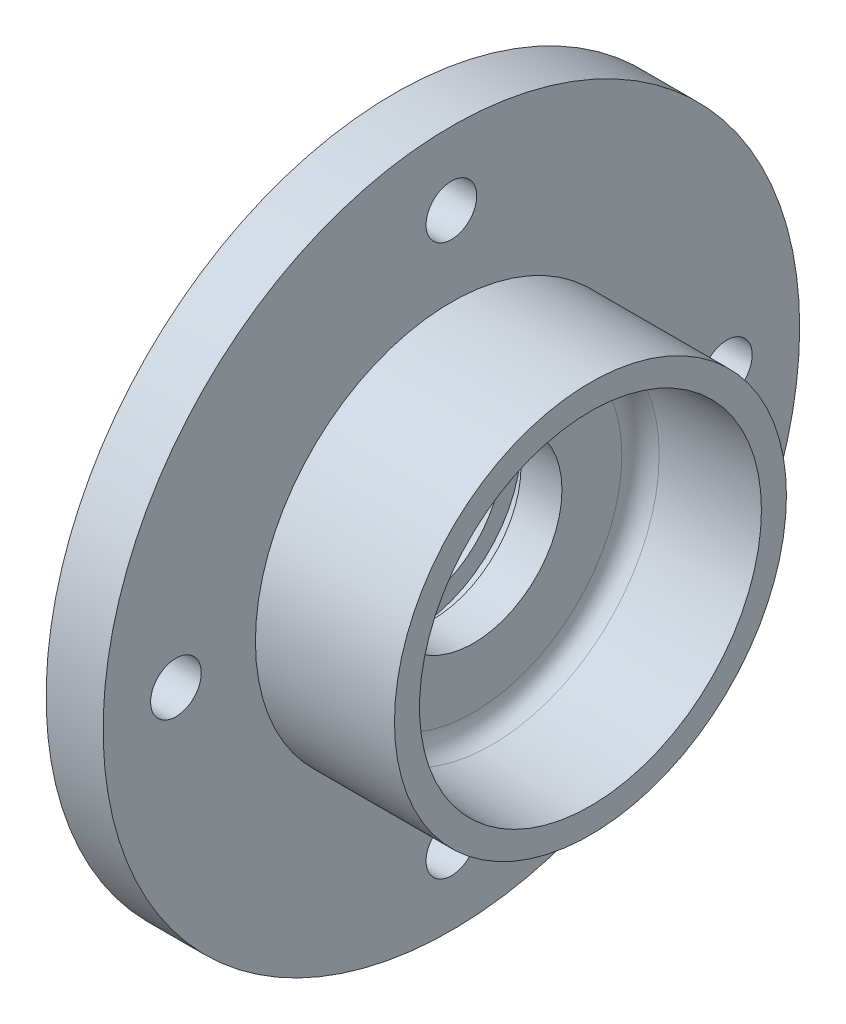
ISO-10303-21;
HEADER;
FILE_DESCRIPTION(('STEP AP214'),'2;1');
FILE_NAME('part.step','',(''),(''),'','','');
FILE_SCHEMA(('AUTOMOTIVE_DESIGN { 1 0 10303 214 1 1 1 1 }'));
ENDSEC;
DATA;
#1=APPLICATION_CONTEXT('core data for automotive mechanical design processes');
#2=APPLICATION_PROTOCOL_DEFINITION('international standard','automotive_design',2000,#1);
#3=PRODUCT_CONTEXT('',#1,'mechanical');
#4=PRODUCT('Part','Part','',(#3));
#5=PRODUCT_RELATED_PRODUCT_CATEGORY('part','',(#4));
#6=PRODUCT_DEFINITION_FORMATION('','',#4);
#7=PRODUCT_DEFINITION_CONTEXT('part definition',#1,'design');
#8=PRODUCT_DEFINITION('design','',#6,#7);
#9=PRODUCT_DEFINITION_SHAPE('','',#8);
#10=(LENGTH_UNIT() NAMED_UNIT(*) SI_UNIT(.MILLI.,.METRE.));
#11=(NAMED_UNIT(*) PLANE_ANGLE_UNIT() SI_UNIT($,.RADIAN.));
#12=(NAMED_UNIT(*) SI_UNIT($,.STERADIAN.) SOLID_ANGLE_UNIT());
#13=UNCERTAINTY_MEASURE_WITH_UNIT(LENGTH_MEASURE(1.E-05),#10,'distance_accuracy_value','');
#14=(GEOMETRIC_REPRESENTATION_CONTEXT(3) GLOBAL_UNCERTAINTY_ASSIGNED_CONTEXT((#13)) GLOBAL_UNIT_ASSIGNED_CONTEXT((#10,
#11,#12)) REPRESENTATION_CONTEXT('',''));
#15=CARTESIAN_POINT('',(0.,0.,0.));
#16=DIRECTION('',(0.,0.,1.));
#17=DIRECTION('',(1.,0.,0.));
#18=AXIS2_PLACEMENT_3D('',#15,#16,#17);
#19=CARTESIAN_POINT('',(-6.04,0.,0.));
#20=DIRECTION('',(1.,0.,0.));
#21=DIRECTION('',(0.,0.,-1.));
#22=AXIS2_PLACEMENT_3D('',#19,#20,#21);
#23=CYLINDRICAL_SURFACE('',#22,14.);
#24=CARTESIAN_POINT('',(3.,0.,0.));
#25=DIRECTION('',(-1.,0.,0.));
#26=DIRECTION('',(0.,0.,1.));
#27=AXIS2_PLACEMENT_3D('',#24,#25,#26);
#28=CIRCLE('',#27,14.);
#29=CARTESIAN_POINT('',(3.,0.,14.));
#30=VERTEX_POINT('',#29);
#31=EDGE_CURVE('E45',#30,#30,#28,.F.);
#32=ORIENTED_EDGE('',*,*,#31,.T.);
#33=EDGE_LOOP('',(#32));
#34=FACE_BOUND('',#33,.T.);
#35=CARTESIAN_POINT('',(1.,0.,0.));
#36=DIRECTION('',(-1.,0.,0.));
#37=DIRECTION('',(0.,0.,1.));
#38=AXIS2_PLACEMENT_3D('',#35,#36,#37);
#39=CIRCLE('',#38,14.);
#40=CARTESIAN_POINT('',(1.,0.,14.));
#41=VERTEX_POINT('',#40);
#42=EDGE_CURVE('E32',#41,#41,#39,.F.);
#43=ORIENTED_EDGE('',*,*,#42,.F.);
#44=EDGE_LOOP('',(#43));
#45=FACE_BOUND('',#44,.T.);
#46=ADVANCED_FACE('F28',(#34,#45),#23,.F.);
#47=CARTESIAN_POINT('',(6.,0.,0.));
#48=DIRECTION('',(1.,0.,0.));
#49=DIRECTION('',(0.,0.,-1.));
#50=AXIS2_PLACEMENT_3D('',#47,#48,#49);
#51=CIRCLE('',#50,14.);
#52=CARTESIAN_POINT('',(6.,0.,-14.));
#53=VERTEX_POINT('',#52);
#54=EDGE_CURVE('E47',#53,#53,#51,.F.);
#55=ORIENTED_EDGE('',*,*,#54,.T.);
#56=EDGE_LOOP('',(#55));
#57=FACE_BOUND('',#56,.T.);
#58=CARTESIAN_POINT('',(12.46,0.,0.));
#59=DIRECTION('',(1.,0.,0.));
#60=DIRECTION('',(0.,0.,-1.));
#61=AXIS2_PLACEMENT_3D('',#58,#59,#60);
#62=CIRCLE('',#61,14.);
#63=CARTESIAN_POINT('',(12.46,0.,-14.));
#64=VERTEX_POINT('',#63);
#65=EDGE_CURVE('E50',#64,#64,#62,.T.);
#66=ORIENTED_EDGE('',*,*,#65,.T.);
#67=EDGE_LOOP('',(#66));
#68=FACE_BOUND('',#67,.T.);
#69=ADVANCED_FACE('F94',(#57,#68),#23,.F.);
#70=CARTESIAN_POINT('',(9.,0.,0.));
#71=DIRECTION('',(1.,0.,0.));
#72=DIRECTION('',(0.,0.,-1.));
#73=AXIS2_PLACEMENT_3D('',#70,#71,#72);
#74=PLANE('',#73);
#75=CARTESIAN_POINT('',(9.,0.,-43.5));
#76=DIRECTION('',(1.,0.,0.));
#77=DIRECTION('',(0.,0.,-1.));
#78=AXIS2_PLACEMENT_3D('',#75,#76,#77);
#79=CIRCLE('',#78,4.00000000000001);
#80=CARTESIAN_POINT('',(9.,0.,-47.5));
#81=VERTEX_POINT('',#80);
#82=EDGE_CURVE('E121',#81,#81,#79,.T.);
#83=ORIENTED_EDGE('',*,*,#82,.F.);
#84=EDGE_LOOP('',(#83));
#85=FACE_BOUND('',#84,.T.);
#86=CARTESIAN_POINT('',(9.,-43.5,0.));
#87=DIRECTION('',(1.,0.,0.));
#88=DIRECTION('',(0.,0.,-1.));
#89=AXIS2_PLACEMENT_3D('',#86,#87,#88);
#90=CIRCLE('',#89,4.);
#91=CARTESIAN_POINT('',(9.,-43.5,-4.));
#92=VERTEX_POINT('',#91);
#93=EDGE_CURVE('E125',#92,#92,#90,.T.);
#94=ORIENTED_EDGE('',*,*,#93,.F.);
#95=EDGE_LOOP('',(#94));
#96=FACE_BOUND('',#95,.T.);
#97=CARTESIAN_POINT('',(9.,0.,43.5));
#98=DIRECTION('',(1.,0.,0.));
#99=DIRECTION('',(0.,0.,-1.));
#100=AXIS2_PLACEMENT_3D('',#97,#98,#99);
#101=CIRCLE('',#100,4.00000000000001);
#102=CARTESIAN_POINT('',(9.,0.,39.5));
#103=VERTEX_POINT('',#102);
#104=EDGE_CURVE('E129',#103,#103,#101,.T.);
#105=ORIENTED_EDGE('',*,*,#104,.F.);
#106=EDGE_LOOP('',(#105));
#107=FACE_BOUND('',#106,.T.);
#108=CARTESIAN_POINT('',(9.,43.5,0.));
#109=DIRECTION('',(1.,0.,0.));
#110=DIRECTION('',(0.,0.,-1.));
#111=AXIS2_PLACEMENT_3D('',#108,#109,#110);
#112=CIRCLE('',#111,4.);
#113=CARTESIAN_POINT('',(9.,43.5,-4.));
#114=VERTEX_POINT('',#113);
#115=EDGE_CURVE('E133',#114,#114,#112,.T.);
#116=ORIENTED_EDGE('',*,*,#115,.F.);
#117=EDGE_LOOP('',(#116));
#118=FACE_BOUND('',#117,.T.);
#119=CARTESIAN_POINT('',(9.,0.,0.));
#120=DIRECTION('',(1.,0.,0.));
#121=DIRECTION('',(0.,0.,-1.));
#122=AXIS2_PLACEMENT_3D('',#119,#120,#121);
#123=CIRCLE('',#122,55.);
#124=CARTESIAN_POINT('',(9.,0.,-55.));
#125=VERTEX_POINT('',#124);
#126=EDGE_CURVE('E41',#125,#125,#123,.T.);
#127=ORIENTED_EDGE('',*,*,#126,.T.);
#128=EDGE_LOOP('',(#127));
#129=FACE_BOUND('',#128,.T.);
#130=CARTESIAN_POINT('',(9.,0.,0.));
#131=DIRECTION('',(1.,0.,0.));
#132=DIRECTION('',(0.,0.,-1.));
#133=AXIS2_PLACEMENT_3D('',#130,#131,#132);
#134=CIRCLE('',#133,30.95);
#135=CARTESIAN_POINT('',(9.,0.,-30.95));
#136=VERTEX_POINT('',#135);
#137=EDGE_CURVE('E59',#136,#136,#134,.T.);
#138=ORIENTED_EDGE('',*,*,#137,.F.);
#139=EDGE_LOOP('',(#138));
#140=FACE_BOUND('',#139,.T.);
#141=ADVANCED_FACE('F88',(#85,#96,#107,#118,#129,#140),#74,.T.);
#142=CARTESIAN_POINT('',(9.,0.,0.));
#143=DIRECTION('',(-1.,0.,0.));
#144=DIRECTION('',(0.,0.,1.));
#145=AXIS2_PLACEMENT_3D('',#142,#143,#144);
#146=CYLINDRICAL_SURFACE('',#145,55.);
#147=ORIENTED_EDGE('',*,*,#126,.F.);
#148=EDGE_LOOP('',(#147));
#149=FACE_BOUND('',#148,.T.);
#150=CARTESIAN_POINT('',(0.,0.,0.));
#151=DIRECTION('',(1.,0.,0.));
#152=DIRECTION('',(0.,0.,-1.));
#153=AXIS2_PLACEMENT_3D('',#150,#151,#152);
#154=CIRCLE('',#153,55.);
#155=CARTESIAN_POINT('',(0.,0.,-55.));
#156=VERTEX_POINT('',#155);
#157=EDGE_CURVE('E67',#156,#156,#154,.T.);
#158=ORIENTED_EDGE('',*,*,#157,.T.);
#159=EDGE_LOOP('',(#158));
#160=FACE_BOUND('',#159,.T.);
#161=ADVANCED_FACE('F74',(#149,#160),#146,.T.);
#162=CARTESIAN_POINT('',(0.,0.,0.));
#163=DIRECTION('',(1.,0.,0.));
#164=DIRECTION('',(0.,0.,-1.));
#165=AXIS2_PLACEMENT_3D('',#162,#163,#164);
#166=PLANE('',#165);
#167=CARTESIAN_POINT('',(0.,0.,-43.5));
#168=DIRECTION('',(-1.,0.,0.));
#169=DIRECTION('',(0.,0.,1.));
#170=AXIS2_PLACEMENT_3D('',#167,#168,#169);
#171=CIRCLE('',#170,4.00000000000001);
#172=CARTESIAN_POINT('',(0.,0.,-39.5));
#173=VERTEX_POINT('',#172);
#174=EDGE_CURVE('E309',#173,#173,#171,.T.);
#175=ORIENTED_EDGE('',*,*,#174,.F.);
#176=EDGE_LOOP('',(#175));
#177=FACE_BOUND('',#176,.T.);
#178=CARTESIAN_POINT('',(0.,-43.5,0.));
#179=DIRECTION('',(-1.,0.,0.));
#180=DIRECTION('',(0.,0.,1.));
#181=AXIS2_PLACEMENT_3D('',#178,#179,#180);
#182=CIRCLE('',#181,4.);
#183=CARTESIAN_POINT('',(0.,-43.5,4.));
#184=VERTEX_POINT('',#183);
#185=EDGE_CURVE('E311',#184,#184,#182,.T.);
#186=ORIENTED_EDGE('',*,*,#185,.F.);
#187=EDGE_LOOP('',(#186));
#188=FACE_BOUND('',#187,.T.);
#189=CARTESIAN_POINT('',(0.,0.,43.5));
#190=DIRECTION('',(-1.,0.,0.));
#191=DIRECTION('',(0.,0.,1.));
#192=AXIS2_PLACEMENT_3D('',#189,#190,#191);
#193=CIRCLE('',#192,4.00000000000001);
#194=CARTESIAN_POINT('',(0.,0.,47.5));
#195=VERTEX_POINT('',#194);
#196=EDGE_CURVE('E317',#195,#195,#193,.T.);
#197=ORIENTED_EDGE('',*,*,#196,.F.);
#198=EDGE_LOOP('',(#197));
#199=FACE_BOUND('',#198,.T.);
#200=CARTESIAN_POINT('',(0.,43.5,0.));
#201=DIRECTION('',(-1.,0.,0.));
#202=DIRECTION('',(0.,0.,1.));
#203=AXIS2_PLACEMENT_3D('',#200,#201,#202);
#204=CIRCLE('',#203,4.);
#205=CARTESIAN_POINT('',(0.,43.5,4.));
#206=VERTEX_POINT('',#205);
#207=EDGE_CURVE('E140',#206,#206,#204,.T.);
#208=ORIENTED_EDGE('',*,*,#207,.F.);
#209=EDGE_LOOP('',(#208));
#210=FACE_BOUND('',#209,.T.);
#211=CARTESIAN_POINT('',(0.,0.,0.));
#212=DIRECTION('',(-1.,0.,0.));
#213=DIRECTION('',(0.,0.,1.));
#214=AXIS2_PLACEMENT_3D('',#211,#212,#213);
#215=CIRCLE('',#214,32.);
#216=CARTESIAN_POINT('',(0.,0.,32.));
#217=VERTEX_POINT('',#216);
#218=EDGE_CURVE('E139',#217,#217,#215,.T.);
#219=ORIENTED_EDGE('',*,*,#218,.F.);
#220=EDGE_LOOP('',(#219));
#221=FACE_BOUND('',#220,.T.);
#222=ORIENTED_EDGE('',*,*,#157,.F.);
#223=EDGE_LOOP('',(#222));
#224=FACE_BOUND('',#223,.T.);
#225=ADVANCED_FACE('F76',(#177,#188,#199,#210,#221,#224),#166,.F.);
#226=CARTESIAN_POINT('',(30.96,0.,0.));
#227=DIRECTION('',(-1.,0.,0.));
#228=DIRECTION('',(0.,0.,1.));
#229=AXIS2_PLACEMENT_3D('',#226,#227,#228);
#230=CYLINDRICAL_SURFACE('',#229,30.95);
#231=CARTESIAN_POINT('',(30.96,0.,0.));
#232=DIRECTION('',(1.,0.,0.));
#233=DIRECTION('',(0.,0.,-1.));
#234=AXIS2_PLACEMENT_3D('',#231,#232,#233);
#235=CIRCLE('',#234,30.95);
#236=CARTESIAN_POINT('',(30.96,0.,-30.95));
#237=VERTEX_POINT('',#236);
#238=EDGE_CURVE('E64',#237,#237,#235,.T.);
#239=ORIENTED_EDGE('',*,*,#238,.F.);
#240=EDGE_LOOP('',(#239));
#241=FACE_BOUND('',#240,.T.);
#242=ORIENTED_EDGE('',*,*,#137,.T.);
#243=EDGE_LOOP('',(#242));
#244=FACE_BOUND('',#243,.T.);
#245=ADVANCED_FACE('F78',(#241,#244),#230,.T.);
#246=CARTESIAN_POINT('',(30.96,0.,0.));
#247=DIRECTION('',(1.,0.,0.));
#248=DIRECTION('',(0.,0.,-1.));
#249=AXIS2_PLACEMENT_3D('',#246,#247,#248);
#250=PLANE('',#249);
#251=CARTESIAN_POINT('',(30.96,0.,0.));
#252=DIRECTION('',(1.,0.,0.));
#253=DIRECTION('',(0.,0.,-1.));
#254=AXIS2_PLACEMENT_3D('',#251,#252,#253);
#255=CIRCLE('',#254,27.);
#256=CARTESIAN_POINT('',(30.96,0.,-27.));
#257=VERTEX_POINT('',#256);
#258=EDGE_CURVE('E54',#257,#257,#255,.T.);
#259=ORIENTED_EDGE('',*,*,#258,.F.);
#260=EDGE_LOOP('',(#259));
#261=FACE_BOUND('',#260,.T.);
#262=ORIENTED_EDGE('',*,*,#238,.T.);
#263=EDGE_LOOP('',(#262));
#264=FACE_BOUND('',#263,.T.);
#265=ADVANCED_FACE('F85',(#261,#264),#250,.T.);
#266=CARTESIAN_POINT('',(30.96,0.,0.));
#267=DIRECTION('',(1.,0.,0.));
#268=DIRECTION('',(0.,0.,-1.));
#269=AXIS2_PLACEMENT_3D('',#266,#267,#268);
#270=CONICAL_SURFACE('',#269,27.,0.0349065850398867);
#271=CARTESIAN_POINT('',(15.3553015098925,0.,0.));
#272=DIRECTION('',(-1.,0.,0.));
#273=DIRECTION('',(0.,0.,1.));
#274=AXIS2_PLACEMENT_3D('',#271,#272,#273);
#275=CIRCLE('',#274,26.4550719210387);
#276=CARTESIAN_POINT('',(15.3553015098925,0.,26.4550719210387));
#277=VERTEX_POINT('',#276);
#278=EDGE_CURVE('E10',#277,#277,#275,.T.);
#279=ORIENTED_EDGE('',*,*,#278,.T.);
#280=EDGE_LOOP('',(#279));
#281=FACE_BOUND('',#280,.T.);
#282=ORIENTED_EDGE('',*,*,#258,.T.);
#283=EDGE_LOOP('',(#282));
#284=FACE_BOUND('',#283,.T.);
#285=ADVANCED_FACE('F108',(#281,#284),#270,.F.);
#286=CARTESIAN_POINT('',(12.46,0.,0.));
#287=DIRECTION('',(1.,0.,0.));
#288=DIRECTION('',(0.,0.,-1.));
#289=AXIS2_PLACEMENT_3D('',#286,#287,#288);
#290=PLANE('',#289);
#291=ORIENTED_EDGE('',*,*,#65,.F.);
#292=EDGE_LOOP('',(#291));
#293=FACE_BOUND('',#292,.T.);
#294=CARTESIAN_POINT('',(12.46,0.,0.));
#295=DIRECTION('',(1.,0.,0.));
#296=DIRECTION('',(0.,0.,-1.));
#297=AXIS2_PLACEMENT_3D('',#294,#295,#296);
#298=CIRCLE('',#297,23.4568994399814);
#299=CARTESIAN_POINT('',(12.46,0.,-23.4568994399814));
#300=VERTEX_POINT('',#299);
#301=EDGE_CURVE('E36',#300,#300,#298,.T.);
#302=ORIENTED_EDGE('',*,*,#301,.T.);
#303=EDGE_LOOP('',(#302));
#304=FACE_BOUND('',#303,.T.);
#305=ADVANCED_FACE('F105',(#293,#304),#290,.T.);
#306=CARTESIAN_POINT('',(15.46,0.,0.));
#307=DIRECTION('',(1.,0.,0.));
#308=DIRECTION('',(0.,0.,-1.));
#309=AXIS2_PLACEMENT_3D('',#306,#307,#308);
#310=TOROIDAL_SURFACE('',#309,23.4568994399814,3.);
#311=ORIENTED_EDGE('',*,*,#278,.F.);
#312=EDGE_LOOP('',(#311));
#313=FACE_BOUND('',#312,.T.);
#314=ORIENTED_EDGE('',*,*,#301,.F.);
#315=EDGE_LOOP('',(#314));
#316=FACE_BOUND('',#315,.T.);
#317=ADVANCED_FACE('F30',(#313,#316),#310,.F.);
#318=CARTESIAN_POINT('',(6.,0.,11.));
#319=DIRECTION('',(1.,0.,0.));
#320=DIRECTION('',(0.,0.,-1.));
#321=AXIS2_PLACEMENT_3D('',#318,#319,#320);
#322=PLANE('',#321);
#323=CARTESIAN_POINT('',(6.,0.,0.));
#324=DIRECTION('',(-1.,0.,0.));
#325=DIRECTION('',(0.,0.,1.));
#326=AXIS2_PLACEMENT_3D('',#323,#324,#325);
#327=CIRCLE('',#326,17.);
#328=CARTESIAN_POINT('',(6.,0.,17.));
#329=VERTEX_POINT('',#328);
#330=EDGE_CURVE('E150',#329,#329,#327,.T.);
#331=ORIENTED_EDGE('',*,*,#330,.T.);
#332=EDGE_LOOP('',(#331));
#333=FACE_BOUND('',#332,.T.);
#334=ORIENTED_EDGE('',*,*,#54,.F.);
#335=EDGE_LOOP('',(#334));
#336=FACE_BOUND('',#335,.T.);
#337=ADVANCED_FACE('F103',(#333,#336),#322,.F.);
#338=CARTESIAN_POINT('',(3.,0.,11.));
#339=DIRECTION('',(-1.,0.,0.));
#340=DIRECTION('',(0.,0.,1.));
#341=AXIS2_PLACEMENT_3D('',#338,#339,#340);
#342=PLANE('',#341);
#343=CARTESIAN_POINT('',(3.,0.,0.));
#344=DIRECTION('',(-1.,0.,0.));
#345=DIRECTION('',(0.,0.,1.));
#346=AXIS2_PLACEMENT_3D('',#343,#344,#345);
#347=CIRCLE('',#346,17.);
#348=CARTESIAN_POINT('',(3.,0.,17.));
#349=VERTEX_POINT('',#348);
#350=EDGE_CURVE('E48',#349,#349,#347,.T.);
#351=ORIENTED_EDGE('',*,*,#350,.F.);
#352=EDGE_LOOP('',(#351));
#353=FACE_BOUND('',#352,.T.);
#354=ORIENTED_EDGE('',*,*,#31,.F.);
#355=EDGE_LOOP('',(#354));
#356=FACE_BOUND('',#355,.T.);
#357=ADVANCED_FACE('F171',(#353,#356),#342,.F.);
#358=CARTESIAN_POINT('',(4.5,0.,0.));
#359=DIRECTION('',(-1.,0.,0.));
#360=DIRECTION('',(0.,0.,1.));
#361=AXIS2_PLACEMENT_3D('',#358,#359,#360);
#362=CYLINDRICAL_SURFACE('',#361,17.);
#363=ORIENTED_EDGE('',*,*,#330,.F.);
#364=EDGE_LOOP('',(#363));
#365=FACE_BOUND('',#364,.T.);
#366=ORIENTED_EDGE('',*,*,#350,.T.);
#367=EDGE_LOOP('',(#366));
#368=FACE_BOUND('',#367,.T.);
#369=ADVANCED_FACE('F161',(#365,#368),#362,.F.);
#370=CARTESIAN_POINT('',(1.,0.,0.));
#371=DIRECTION('',(-1.,0.,0.));
#372=DIRECTION('',(0.,0.,1.));
#373=AXIS2_PLACEMENT_3D('',#370,#371,#372);
#374=PLANE('',#373);
#375=CARTESIAN_POINT('',(1.,0.,0.));
#376=DIRECTION('',(-1.,0.,0.));
#377=DIRECTION('',(0.,0.,1.));
#378=AXIS2_PLACEMENT_3D('',#375,#376,#377);
#379=CIRCLE('',#378,32.);
#380=CARTESIAN_POINT('',(1.,0.,32.));
#381=VERTEX_POINT('',#380);
#382=EDGE_CURVE('E143',#381,#381,#379,.T.);
#383=ORIENTED_EDGE('',*,*,#382,.T.);
#384=EDGE_LOOP('',(#383));
#385=FACE_BOUND('',#384,.T.);
#386=ORIENTED_EDGE('',*,*,#42,.T.);
#387=EDGE_LOOP('',(#386));
#388=FACE_BOUND('',#387,.T.);
#389=ADVANCED_FACE('F158',(#385,#388),#374,.T.);
#390=CARTESIAN_POINT('',(1.,0.,0.));
#391=DIRECTION('',(-1.,0.,0.));
#392=DIRECTION('',(0.,0.,1.));
#393=AXIS2_PLACEMENT_3D('',#390,#391,#392);
#394=CYLINDRICAL_SURFACE('',#393,32.);
#395=ORIENTED_EDGE('',*,*,#382,.F.);
#396=EDGE_LOOP('',(#395));
#397=FACE_BOUND('',#396,.T.);
#398=ORIENTED_EDGE('',*,*,#218,.T.);
#399=EDGE_LOOP('',(#398));
#400=FACE_BOUND('',#399,.T.);
#401=ADVANCED_FACE('F160',(#397,#400),#394,.F.);
#402=CARTESIAN_POINT('',(20.,43.5,0.));
#403=DIRECTION('',(-1.,0.,0.));
#404=DIRECTION('',(0.,0.,1.));
#405=AXIS2_PLACEMENT_3D('',#402,#403,#404);
#406=CYLINDRICAL_SURFACE('',#405,4.);
#407=ORIENTED_EDGE('',*,*,#115,.T.);
#408=EDGE_LOOP('',(#407));
#409=FACE_BOUND('',#408,.T.);
#410=ORIENTED_EDGE('',*,*,#207,.T.);
#411=EDGE_LOOP('',(#410));
#412=FACE_BOUND('',#411,.T.);
#413=ADVANCED_FACE('F168',(#409,#412),#406,.F.);
#414=CARTESIAN_POINT('',(20.,0.,43.5));
#415=DIRECTION('',(-1.,0.,0.));
#416=DIRECTION('',(0.,0.,1.));
#417=AXIS2_PLACEMENT_3D('',#414,#415,#416);
#418=CYLINDRICAL_SURFACE('',#417,4.00000000000001);
#419=ORIENTED_EDGE('',*,*,#104,.T.);
#420=EDGE_LOOP('',(#419));
#421=FACE_BOUND('',#420,.T.);
#422=ORIENTED_EDGE('',*,*,#196,.T.);
#423=EDGE_LOOP('',(#422));
#424=FACE_BOUND('',#423,.T.);
#425=ADVANCED_FACE('F276',(#421,#424),#418,.F.);
#426=CARTESIAN_POINT('',(20.,-43.5,0.));
#427=DIRECTION('',(-1.,0.,0.));
#428=DIRECTION('',(0.,0.,1.));
#429=AXIS2_PLACEMENT_3D('',#426,#427,#428);
#430=CYLINDRICAL_SURFACE('',#429,4.);
#431=ORIENTED_EDGE('',*,*,#93,.T.);
#432=EDGE_LOOP('',(#431));
#433=FACE_BOUND('',#432,.T.);
#434=ORIENTED_EDGE('',*,*,#185,.T.);
#435=EDGE_LOOP('',(#434));
#436=FACE_BOUND('',#435,.T.);
#437=ADVANCED_FACE('F281',(#433,#436),#430,.F.);
#438=CARTESIAN_POINT('',(20.,0.,-43.5));
#439=DIRECTION('',(-1.,0.,0.));
#440=DIRECTION('',(0.,0.,1.));
#441=AXIS2_PLACEMENT_3D('',#438,#439,#440);
#442=CYLINDRICAL_SURFACE('',#441,4.00000000000001);
#443=ORIENTED_EDGE('',*,*,#82,.T.);
#444=EDGE_LOOP('',(#443));
#445=FACE_BOUND('',#444,.T.);
#446=ORIENTED_EDGE('',*,*,#174,.T.);
#447=EDGE_LOOP('',(#446));
#448=FACE_BOUND('',#447,.T.);
#449=ADVANCED_FACE('F288',(#445,#448),#442,.F.);
#450=CLOSED_SHELL('',(#46,#69,#141,#161,#225,#245,#265,#285,#305,#317,#337,#357,#369,#389,#401,
#413,#425,#437,#449));
#451=MANIFOLD_SOLID_BREP('B2',#450);
#452=ADVANCED_BREP_SHAPE_REPRESENTATION('',(#18,#451),#14);
#453=SHAPE_DEFINITION_REPRESENTATION(#9,#452);
ENDSEC;
END-ISO-10303-21;
